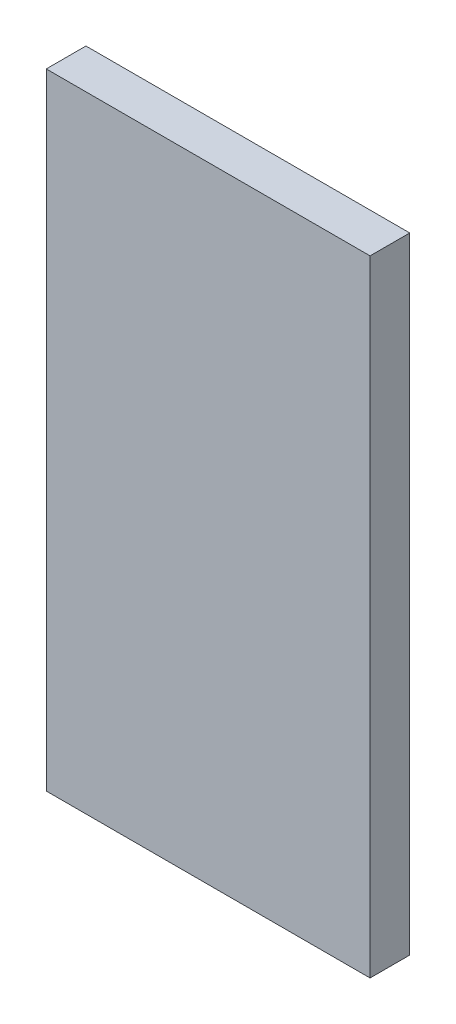
ISO-10303-21;
HEADER;
FILE_DESCRIPTION(('STEP AP214'),'2;1');
FILE_NAME('part.step','',(''),(''),'','','');
FILE_SCHEMA(('AUTOMOTIVE_DESIGN { 1 0 10303 214 1 1 1 1 }'));
ENDSEC;
DATA;
#1=APPLICATION_CONTEXT('core data for automotive mechanical design processes');
#2=APPLICATION_PROTOCOL_DEFINITION('international standard','automotive_design',2000,#1);
#3=PRODUCT_CONTEXT('',#1,'mechanical');
#4=PRODUCT('Part','Part','',(#3));
#5=PRODUCT_RELATED_PRODUCT_CATEGORY('part','',(#4));
#6=PRODUCT_DEFINITION_FORMATION('','',#4);
#7=PRODUCT_DEFINITION_CONTEXT('part definition',#1,'design');
#8=PRODUCT_DEFINITION('design','',#6,#7);
#9=PRODUCT_DEFINITION_SHAPE('','',#8);
#10=(LENGTH_UNIT() NAMED_UNIT(*) SI_UNIT(.MILLI.,.METRE.));
#11=(NAMED_UNIT(*) PLANE_ANGLE_UNIT() SI_UNIT($,.RADIAN.));
#12=(NAMED_UNIT(*) SI_UNIT($,.STERADIAN.) SOLID_ANGLE_UNIT());
#13=UNCERTAINTY_MEASURE_WITH_UNIT(LENGTH_MEASURE(1.E-05),#10,'distance_accuracy_value','');
#14=(GEOMETRIC_REPRESENTATION_CONTEXT(3) GLOBAL_UNCERTAINTY_ASSIGNED_CONTEXT((#13)) GLOBAL_UNIT_ASSIGNED_CONTEXT((#10,
#11,#12)) REPRESENTATION_CONTEXT('',''));
#15=CARTESIAN_POINT('',(0.,0.,0.));
#16=DIRECTION('',(0.,0.,1.));
#17=DIRECTION('',(1.,0.,0.));
#18=AXIS2_PLACEMENT_3D('',#15,#16,#17);
#19=CARTESIAN_POINT('',(-8.028,-3.698,0.1));
#20=DIRECTION('',(0.,0.,1.));
#21=DIRECTION('',(1.,0.,0.));
#22=AXIS2_PLACEMENT_3D('',#19,#20,#21);
#23=PLANE('',#22);
#24=DIRECTION('',(0.,1.,0.));
#25=VECTOR('',#24,1.);
#26=CARTESIAN_POINT('',(-7.212,-3.698,0.1));
#27=LINE('',#26,#25);
#28=CARTESIAN_POINT('',(-7.212,-2.122,0.1));
#29=VERTEX_POINT('',#28);
#30=CARTESIAN_POINT('',(-7.212,-3.698,0.1));
#31=VERTEX_POINT('',#30);
#32=EDGE_CURVE('E75',#29,#31,#27,.F.);
#33=ORIENTED_EDGE('',*,*,#32,.F.);
#34=DIRECTION('',(1.,0.,0.));
#35=VECTOR('',#34,1.);
#36=CARTESIAN_POINT('',(-8.028,-2.122,0.1));
#37=LINE('',#36,#35);
#38=CARTESIAN_POINT('',(-8.028,-2.122,0.1));
#39=VERTEX_POINT('',#38);
#40=EDGE_CURVE('E57',#39,#29,#37,.T.);
#41=ORIENTED_EDGE('',*,*,#40,.F.);
#42=DIRECTION('',(0.,1.,0.));
#43=VECTOR('',#42,1.);
#44=CARTESIAN_POINT('',(-8.028,-3.698,0.1));
#45=LINE('',#44,#43);
#46=CARTESIAN_POINT('',(-8.028,-3.698,0.1));
#47=VERTEX_POINT('',#46);
#48=EDGE_CURVE('E19',#39,#47,#45,.F.);
#49=ORIENTED_EDGE('',*,*,#48,.T.);
#50=DIRECTION('',(1.,0.,0.));
#51=VECTOR('',#50,1.);
#52=CARTESIAN_POINT('',(-8.028,-3.698,0.1));
#53=LINE('',#52,#51);
#54=EDGE_CURVE('E54',#47,#31,#53,.T.);
#55=ORIENTED_EDGE('',*,*,#54,.T.);
#56=EDGE_LOOP('',(#33,#41,#49,#55));
#57=FACE_BOUND('',#56,.T.);
#58=ADVANCED_FACE('F16',(#57),#23,.T.);
#59=CARTESIAN_POINT('',(-8.028,-3.698,0.));
#60=DIRECTION('',(1.,0.,0.));
#61=DIRECTION('',(0.,0.,-1.));
#62=AXIS2_PLACEMENT_3D('',#59,#60,#61);
#63=PLANE('',#62);
#64=DIRECTION('',(0.,0.,1.));
#65=VECTOR('',#64,1.);
#66=CARTESIAN_POINT('',(-8.028,-2.122,0.));
#67=LINE('',#66,#65);
#68=CARTESIAN_POINT('',(-8.028,-2.122,0.));
#69=VERTEX_POINT('',#68);
#70=EDGE_CURVE('E77',#69,#39,#67,.T.);
#71=ORIENTED_EDGE('',*,*,#70,.F.);
#72=DIRECTION('',(0.,1.,0.));
#73=VECTOR('',#72,1.);
#74=CARTESIAN_POINT('',(-8.028,-3.698,0.));
#75=LINE('',#74,#73);
#76=CARTESIAN_POINT('',(-8.028,-3.698,0.));
#77=VERTEX_POINT('',#76);
#78=EDGE_CURVE('E72',#69,#77,#75,.F.);
#79=ORIENTED_EDGE('',*,*,#78,.T.);
#80=DIRECTION('',(0.,0.,1.));
#81=VECTOR('',#80,1.);
#82=CARTESIAN_POINT('',(-8.028,-3.698,0.));
#83=LINE('',#82,#81);
#84=EDGE_CURVE('E62',#77,#47,#83,.T.);
#85=ORIENTED_EDGE('',*,*,#84,.T.);
#86=ORIENTED_EDGE('',*,*,#48,.F.);
#87=EDGE_LOOP('',(#71,#79,#85,#86));
#88=FACE_BOUND('',#87,.T.);
#89=ADVANCED_FACE('F71',(#88),#63,.F.);
#90=CARTESIAN_POINT('',(-8.028,-3.698,0.));
#91=DIRECTION('',(0.,1.,0.));
#92=DIRECTION('',(0.,0.,1.));
#93=AXIS2_PLACEMENT_3D('',#90,#91,#92);
#94=PLANE('',#93);
#95=ORIENTED_EDGE('',*,*,#54,.F.);
#96=ORIENTED_EDGE('',*,*,#84,.F.);
#97=DIRECTION('',(1.,0.,0.));
#98=VECTOR('',#97,1.);
#99=CARTESIAN_POINT('',(-8.028,-3.698,0.));
#100=LINE('',#99,#98);
#101=CARTESIAN_POINT('',(-7.212,-3.698,0.));
#102=VERTEX_POINT('',#101);
#103=EDGE_CURVE('E82',#77,#102,#100,.T.);
#104=ORIENTED_EDGE('',*,*,#103,.T.);
#105=DIRECTION('',(0.,0.,-1.));
#106=VECTOR('',#105,1.);
#107=CARTESIAN_POINT('',(-7.212,-3.698,0.));
#108=LINE('',#107,#106);
#109=EDGE_CURVE('E68',#31,#102,#108,.T.);
#110=ORIENTED_EDGE('',*,*,#109,.F.);
#111=EDGE_LOOP('',(#95,#96,#104,#110));
#112=FACE_BOUND('',#111,.T.);
#113=ADVANCED_FACE('F65',(#112),#94,.F.);
#114=CARTESIAN_POINT('',(-7.212,-3.698,0.));
#115=DIRECTION('',(1.,0.,0.));
#116=DIRECTION('',(0.,0.,-1.));
#117=AXIS2_PLACEMENT_3D('',#114,#115,#116);
#118=PLANE('',#117);
#119=DIRECTION('',(0.,0.,1.));
#120=VECTOR('',#119,1.);
#121=CARTESIAN_POINT('',(-7.212,-2.122,0.));
#122=LINE('',#121,#120);
#123=CARTESIAN_POINT('',(-7.212,-2.122,0.));
#124=VERTEX_POINT('',#123);
#125=EDGE_CURVE('E33',#29,#124,#122,.F.);
#126=ORIENTED_EDGE('',*,*,#125,.F.);
#127=ORIENTED_EDGE('',*,*,#32,.T.);
#128=ORIENTED_EDGE('',*,*,#109,.T.);
#129=DIRECTION('',(0.,1.,0.));
#130=VECTOR('',#129,1.);
#131=CARTESIAN_POINT('',(-7.212,-3.698,0.));
#132=LINE('',#131,#130);
#133=EDGE_CURVE('E25',#102,#124,#132,.T.);
#134=ORIENTED_EDGE('',*,*,#133,.T.);
#135=EDGE_LOOP('',(#126,#127,#128,#134));
#136=FACE_BOUND('',#135,.T.);
#137=ADVANCED_FACE('F87',(#136),#118,.T.);
#138=CARTESIAN_POINT('',(-8.028,-2.122,0.));
#139=DIRECTION('',(0.,1.,0.));
#140=DIRECTION('',(0.,0.,1.));
#141=AXIS2_PLACEMENT_3D('',#138,#139,#140);
#142=PLANE('',#141);
#143=ORIENTED_EDGE('',*,*,#40,.T.);
#144=ORIENTED_EDGE('',*,*,#125,.T.);
#145=DIRECTION('',(1.,0.,0.));
#146=VECTOR('',#145,1.);
#147=CARTESIAN_POINT('',(-8.028,-2.122,0.));
#148=LINE('',#147,#146);
#149=EDGE_CURVE('E11',#124,#69,#148,.F.);
#150=ORIENTED_EDGE('',*,*,#149,.T.);
#151=ORIENTED_EDGE('',*,*,#70,.T.);
#152=EDGE_LOOP('',(#143,#144,#150,#151));
#153=FACE_BOUND('',#152,.T.);
#154=ADVANCED_FACE('F90',(#153),#142,.T.);
#155=CARTESIAN_POINT('',(-8.028,-3.698,0.));
#156=DIRECTION('',(0.,0.,1.));
#157=DIRECTION('',(1.,0.,0.));
#158=AXIS2_PLACEMENT_3D('',#155,#156,#157);
#159=PLANE('',#158);
#160=ORIENTED_EDGE('',*,*,#133,.F.);
#161=ORIENTED_EDGE('',*,*,#103,.F.);
#162=ORIENTED_EDGE('',*,*,#78,.F.);
#163=ORIENTED_EDGE('',*,*,#149,.F.);
#164=EDGE_LOOP('',(#160,#161,#162,#163));
#165=FACE_BOUND('',#164,.T.);
#166=ADVANCED_FACE('F89',(#165),#159,.F.);
#167=CLOSED_SHELL('',(#58,#89,#113,#137,#154,#166));
#168=MANIFOLD_SOLID_BREP('B1',#167);
#169=ADVANCED_BREP_SHAPE_REPRESENTATION('',(#18,#168),#14);
#170=SHAPE_DEFINITION_REPRESENTATION(#9,#169);
ENDSEC;
END-ISO-10303-21;
